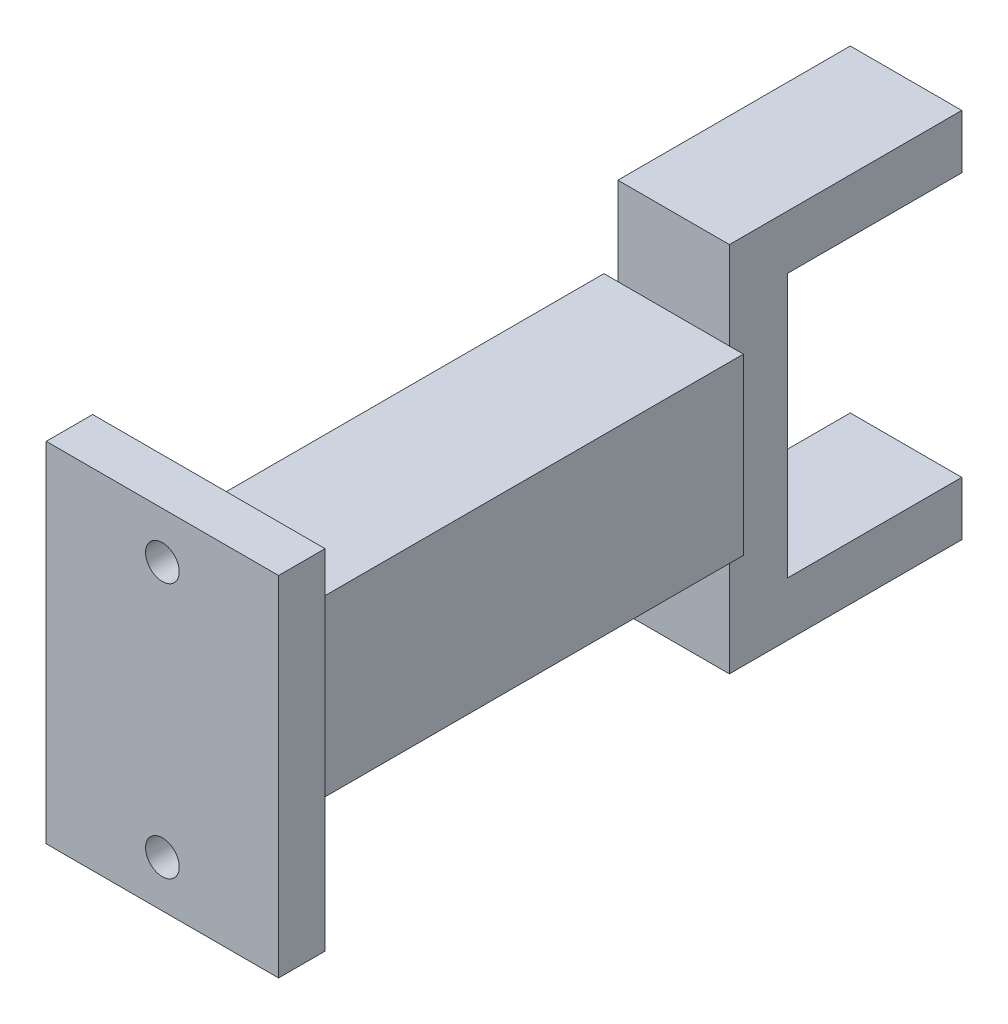
ISO-10303-21;
HEADER;
FILE_DESCRIPTION(('STEP AP214'),'2;1');
FILE_NAME('part.step','',(''),(''),'','','');
FILE_SCHEMA(('AUTOMOTIVE_DESIGN { 1 0 10303 214 1 1 1 1 }'));
ENDSEC;
DATA;
#1=APPLICATION_CONTEXT('core data for automotive mechanical design processes');
#2=APPLICATION_PROTOCOL_DEFINITION('international standard','automotive_design',2000,#1);
#3=PRODUCT_CONTEXT('',#1,'mechanical');
#4=PRODUCT('Part','Part','',(#3));
#5=PRODUCT_RELATED_PRODUCT_CATEGORY('part','',(#4));
#6=PRODUCT_DEFINITION_FORMATION('','',#4);
#7=PRODUCT_DEFINITION_CONTEXT('part definition',#1,'design');
#8=PRODUCT_DEFINITION('design','',#6,#7);
#9=PRODUCT_DEFINITION_SHAPE('','',#8);
#10=(LENGTH_UNIT() NAMED_UNIT(*) SI_UNIT(.MILLI.,.METRE.));
#11=(NAMED_UNIT(*) PLANE_ANGLE_UNIT() SI_UNIT($,.RADIAN.));
#12=(NAMED_UNIT(*) SI_UNIT($,.STERADIAN.) SOLID_ANGLE_UNIT());
#13=UNCERTAINTY_MEASURE_WITH_UNIT(LENGTH_MEASURE(1.E-05),#10,'distance_accuracy_value','');
#14=(GEOMETRIC_REPRESENTATION_CONTEXT(3) GLOBAL_UNCERTAINTY_ASSIGNED_CONTEXT((#13)) GLOBAL_UNIT_ASSIGNED_CONTEXT((#10,
#11,#12)) REPRESENTATION_CONTEXT('',''));
#15=CARTESIAN_POINT('',(0.,0.,0.));
#16=DIRECTION('',(0.,0.,1.));
#17=DIRECTION('',(1.,0.,0.));
#18=AXIS2_PLACEMENT_3D('',#15,#16,#17);
#19=CARTESIAN_POINT('',(0.,0.,-60.));
#20=DIRECTION('',(0.,0.,-1.));
#21=DIRECTION('',(-1.,0.,0.));
#22=AXIS2_PLACEMENT_3D('',#19,#20,#21);
#23=PLANE('',#22);
#24=DIRECTION('',(-1.,0.,0.));
#25=VECTOR('',#24,1.);
#26=CARTESIAN_POINT('',(2.99494584837546,-11.2924629697789,-60.));
#27=LINE('',#26,#25);
#28=CARTESIAN_POINT('',(2.99494584837546,-11.2924629697789,-60.));
#29=VERTEX_POINT('',#28);
#30=CARTESIAN_POINT('',(-6.60505415162454,-11.2924629697789,-60.));
#31=VERTEX_POINT('',#30);
#32=EDGE_CURVE('E185',#29,#31,#27,.T.);
#33=ORIENTED_EDGE('',*,*,#32,.F.);
#34=DIRECTION('',(0.,-1.,0.));
#35=VECTOR('',#34,1.);
#36=CARTESIAN_POINT('',(2.99494584837546,16.0575370302211,-60.));
#37=LINE('',#36,#35);
#38=CARTESIAN_POINT('',(2.99494584837546,-15.9424629697789,-60.));
#39=VERTEX_POINT('',#38);
#40=EDGE_CURVE('E207',#29,#39,#37,.T.);
#41=ORIENTED_EDGE('',*,*,#40,.T.);
#42=DIRECTION('',(-1.,0.,0.));
#43=VECTOR('',#42,1.);
#44=CARTESIAN_POINT('',(2.99494584837546,-15.9424629697789,-60.));
#45=LINE('',#44,#43);
#46=CARTESIAN_POINT('',(-6.60505415162454,-15.9424629697789,-60.));
#47=VERTEX_POINT('',#46);
#48=EDGE_CURVE('E212',#39,#47,#45,.T.);
#49=ORIENTED_EDGE('',*,*,#48,.T.);
#50=DIRECTION('',(0.,1.,0.));
#51=VECTOR('',#50,1.);
#52=CARTESIAN_POINT('',(-6.60505415162454,16.0575370302211,-60.));
#53=LINE('',#52,#51);
#54=EDGE_CURVE('E200',#47,#31,#53,.T.);
#55=ORIENTED_EDGE('',*,*,#54,.T.);
#56=EDGE_LOOP('',(#33,#41,#49,#55));
#57=FACE_BOUND('',#56,.T.);
#58=ADVANCED_FACE('F39',(#57),#23,.T.);
#59=CARTESIAN_POINT('',(0.,0.,-40.));
#60=DIRECTION('',(0.,0.,-1.));
#61=DIRECTION('',(-1.,0.,0.));
#62=AXIS2_PLACEMENT_3D('',#59,#60,#61);
#63=PLANE('',#62);
#64=DIRECTION('',(0.,1.,0.));
#65=VECTOR('',#64,1.);
#66=CARTESIAN_POINT('',(-6.60505415162454,16.0575370302211,-40.));
#67=LINE('',#66,#65);
#68=CARTESIAN_POINT('',(-6.60505415162454,-6.50722021660649,-40.));
#69=VERTEX_POINT('',#68);
#70=CARTESIAN_POINT('',(-6.60505415162454,8.49277978339351,-40.));
#71=VERTEX_POINT('',#70);
#72=EDGE_CURVE('E11',#69,#71,#67,.T.);
#73=ORIENTED_EDGE('',*,*,#72,.F.);
#74=DIRECTION('',(-1.,0.,0.));
#75=VECTOR('',#74,1.);
#76=CARTESIAN_POINT('',(4.19494584837546,-6.50722021660649,-40.));
#77=LINE('',#76,#75);
#78=CARTESIAN_POINT('',(-7.80505415162454,-6.50722021660649,-40.));
#79=VERTEX_POINT('',#78);
#80=EDGE_CURVE('E258',#69,#79,#77,.T.);
#81=ORIENTED_EDGE('',*,*,#80,.T.);
#82=DIRECTION('',(0.,1.,0.));
#83=VECTOR('',#82,1.);
#84=CARTESIAN_POINT('',(-7.80505415162454,8.49277978339351,-40.));
#85=LINE('',#84,#83);
#86=CARTESIAN_POINT('',(-7.80505415162454,8.49277978339351,-40.));
#87=VERTEX_POINT('',#86);
#88=EDGE_CURVE('E245',#79,#87,#85,.T.);
#89=ORIENTED_EDGE('',*,*,#88,.T.);
#90=DIRECTION('',(1.,0.,0.));
#91=VECTOR('',#90,1.);
#92=CARTESIAN_POINT('',(4.19494584837546,8.49277978339351,-40.));
#93=LINE('',#92,#91);
#94=EDGE_CURVE('E251',#87,#71,#93,.T.);
#95=ORIENTED_EDGE('',*,*,#94,.T.);
#96=EDGE_LOOP('',(#73,#81,#89,#95));
#97=FACE_BOUND('',#96,.T.);
#98=ADVANCED_FACE('F414',(#97),#63,.T.);
#99=CARTESIAN_POINT('',(0.,0.,0.));
#100=DIRECTION('',(0.,0.,1.));
#101=DIRECTION('',(1.,0.,0.));
#102=AXIS2_PLACEMENT_3D('',#99,#100,#101);
#103=PLANE('',#102);
#104=CARTESIAN_POINT('',(-1.80505415162455,-10.0072202166065,0.));
#105=DIRECTION('',(0.,0.,1.));
#106=DIRECTION('',(1.,0.,0.));
#107=AXIS2_PLACEMENT_3D('',#104,#105,#106);
#108=CIRCLE('',#107,1.45);
#109=CARTESIAN_POINT('',(-0.355054151624547,-10.0072202166065,0.));
#110=VERTEX_POINT('',#109);
#111=EDGE_CURVE('E293',#110,#110,#108,.T.);
#112=ORIENTED_EDGE('',*,*,#111,.T.);
#113=EDGE_LOOP('',(#112));
#114=FACE_BOUND('',#113,.T.);
#115=CARTESIAN_POINT('',(-1.80505415162455,11.9927797833935,0.));
#116=DIRECTION('',(0.,0.,1.));
#117=DIRECTION('',(1.,0.,0.));
#118=AXIS2_PLACEMENT_3D('',#115,#116,#117);
#119=CIRCLE('',#118,1.45);
#120=CARTESIAN_POINT('',(-0.355054151624547,11.9927797833935,0.));
#121=VERTEX_POINT('',#120);
#122=EDGE_CURVE('E298',#121,#121,#119,.T.);
#123=ORIENTED_EDGE('',*,*,#122,.T.);
#124=EDGE_LOOP('',(#123));
#125=FACE_BOUND('',#124,.T.);
#126=DIRECTION('',(0.,1.,0.));
#127=VECTOR('',#126,1.);
#128=CARTESIAN_POINT('',(8.19494584837545,15.9927797833935,0.));
#129=LINE('',#128,#127);
#130=CARTESIAN_POINT('',(8.19494584837546,-14.0072202166065,0.));
#131=VERTEX_POINT('',#130);
#132=CARTESIAN_POINT('',(8.19494584837545,15.9927797833935,0.));
#133=VERTEX_POINT('',#132);
#134=EDGE_CURVE('E306',#131,#133,#129,.T.);
#135=ORIENTED_EDGE('',*,*,#134,.F.);
#136=DIRECTION('',(1.,0.,0.));
#137=VECTOR('',#136,1.);
#138=CARTESIAN_POINT('',(-11.8050541516245,-14.0072202166065,0.));
#139=LINE('',#138,#137);
#140=CARTESIAN_POINT('',(-11.8050541516245,-14.0072202166065,0.));
#141=VERTEX_POINT('',#140);
#142=EDGE_CURVE('E315',#141,#131,#139,.T.);
#143=ORIENTED_EDGE('',*,*,#142,.F.);
#144=DIRECTION('',(0.,-1.,0.));
#145=VECTOR('',#144,1.);
#146=CARTESIAN_POINT('',(-11.8050541516245,15.9927797833935,0.));
#147=LINE('',#146,#145);
#148=CARTESIAN_POINT('',(-11.8050541516245,15.9927797833935,0.));
#149=VERTEX_POINT('',#148);
#150=EDGE_CURVE('E331',#149,#141,#147,.T.);
#151=ORIENTED_EDGE('',*,*,#150,.F.);
#152=DIRECTION('',(-1.,0.,0.));
#153=VECTOR('',#152,1.);
#154=CARTESIAN_POINT('',(-11.8050541516245,15.9927797833935,0.));
#155=LINE('',#154,#153);
#156=EDGE_CURVE('E328',#133,#149,#155,.T.);
#157=ORIENTED_EDGE('',*,*,#156,.F.);
#158=EDGE_LOOP('',(#135,#143,#151,#157));
#159=FACE_BOUND('',#158,.T.);
#160=DIRECTION('',(0.,1.,0.));
#161=VECTOR('',#160,1.);
#162=CARTESIAN_POINT('',(-7.80505415162454,8.49277978339351,0.));
#163=LINE('',#162,#161);
#164=CARTESIAN_POINT('',(-7.80505415162454,-6.50722021660649,0.));
#165=VERTEX_POINT('',#164);
#166=CARTESIAN_POINT('',(-7.80505415162454,8.49277978339351,0.));
#167=VERTEX_POINT('',#166);
#168=EDGE_CURVE('E244',#165,#167,#163,.T.);
#169=ORIENTED_EDGE('',*,*,#168,.F.);
#170=DIRECTION('',(-1.,0.,0.));
#171=VECTOR('',#170,1.);
#172=CARTESIAN_POINT('',(4.19494584837546,-6.50722021660649,0.));
#173=LINE('',#172,#171);
#174=CARTESIAN_POINT('',(4.19494584837546,-6.50722021660649,0.));
#175=VERTEX_POINT('',#174);
#176=EDGE_CURVE('E250',#175,#165,#173,.T.);
#177=ORIENTED_EDGE('',*,*,#176,.F.);
#178=DIRECTION('',(0.,-1.,0.));
#179=VECTOR('',#178,1.);
#180=CARTESIAN_POINT('',(4.19494584837546,8.49277978339351,0.));
#181=LINE('',#180,#179);
#182=CARTESIAN_POINT('',(4.19494584837546,8.49277978339351,0.));
#183=VERTEX_POINT('',#182);
#184=EDGE_CURVE('E271',#183,#175,#181,.T.);
#185=ORIENTED_EDGE('',*,*,#184,.F.);
#186=DIRECTION('',(1.,0.,0.));
#187=VECTOR('',#186,1.);
#188=CARTESIAN_POINT('',(4.19494584837546,8.49277978339351,0.));
#189=LINE('',#188,#187);
#190=EDGE_CURVE('E267',#167,#183,#189,.T.);
#191=ORIENTED_EDGE('',*,*,#190,.F.);
#192=EDGE_LOOP('',(#169,#177,#185,#191));
#193=FACE_BOUND('',#192,.T.);
#194=ADVANCED_FACE('F418',(#114,#125,#159,#193),#103,.F.);
#195=CARTESIAN_POINT('',(0.,0.,4.));
#196=DIRECTION('',(0.,0.,1.));
#197=DIRECTION('',(1.,0.,0.));
#198=AXIS2_PLACEMENT_3D('',#195,#196,#197);
#199=PLANE('',#198);
#200=CARTESIAN_POINT('',(-1.80505415162455,11.9927797833935,4.));
#201=DIRECTION('',(0.,0.,1.));
#202=DIRECTION('',(1.,0.,0.));
#203=AXIS2_PLACEMENT_3D('',#200,#201,#202);
#204=CIRCLE('',#203,1.45);
#205=CARTESIAN_POINT('',(-0.355054151624547,11.9927797833935,4.));
#206=VERTEX_POINT('',#205);
#207=EDGE_CURVE('E302',#206,#206,#204,.T.);
#208=ORIENTED_EDGE('',*,*,#207,.F.);
#209=EDGE_LOOP('',(#208));
#210=FACE_BOUND('',#209,.T.);
#211=DIRECTION('',(0.,1.,0.));
#212=VECTOR('',#211,1.);
#213=CARTESIAN_POINT('',(8.19494584837545,15.9927797833935,4.));
#214=LINE('',#213,#212);
#215=CARTESIAN_POINT('',(8.19494584837546,-14.0072202166065,4.));
#216=VERTEX_POINT('',#215);
#217=CARTESIAN_POINT('',(8.19494584837545,15.9927797833935,4.));
#218=VERTEX_POINT('',#217);
#219=EDGE_CURVE('E310',#216,#218,#214,.T.);
#220=ORIENTED_EDGE('',*,*,#219,.T.);
#221=DIRECTION('',(-1.,0.,0.));
#222=VECTOR('',#221,1.);
#223=CARTESIAN_POINT('',(-11.8050541516245,15.9927797833935,4.));
#224=LINE('',#223,#222);
#225=CARTESIAN_POINT('',(-11.8050541516245,15.9927797833935,4.));
#226=VERTEX_POINT('',#225);
#227=EDGE_CURVE('E314',#218,#226,#224,.T.);
#228=ORIENTED_EDGE('',*,*,#227,.T.);
#229=DIRECTION('',(0.,-1.,0.));
#230=VECTOR('',#229,1.);
#231=CARTESIAN_POINT('',(-11.8050541516245,15.9927797833935,4.));
#232=LINE('',#231,#230);
#233=CARTESIAN_POINT('',(-11.8050541516245,-14.0072202166065,4.));
#234=VERTEX_POINT('',#233);
#235=EDGE_CURVE('E318',#226,#234,#232,.T.);
#236=ORIENTED_EDGE('',*,*,#235,.T.);
#237=DIRECTION('',(1.,0.,0.));
#238=VECTOR('',#237,1.);
#239=CARTESIAN_POINT('',(-11.8050541516245,-14.0072202166065,4.));
#240=LINE('',#239,#238);
#241=EDGE_CURVE('E321',#234,#216,#240,.T.);
#242=ORIENTED_EDGE('',*,*,#241,.T.);
#243=EDGE_LOOP('',(#220,#228,#236,#242));
#244=FACE_BOUND('',#243,.T.);
#245=CARTESIAN_POINT('',(-1.80505415162455,-10.0072202166065,4.));
#246=DIRECTION('',(0.,0.,1.));
#247=DIRECTION('',(1.,0.,0.));
#248=AXIS2_PLACEMENT_3D('',#245,#246,#247);
#249=CIRCLE('',#248,1.45);
#250=CARTESIAN_POINT('',(-0.355054151624547,-10.0072202166065,4.));
#251=VERTEX_POINT('',#250);
#252=EDGE_CURVE('E294',#251,#251,#249,.T.);
#253=ORIENTED_EDGE('',*,*,#252,.F.);
#254=EDGE_LOOP('',(#253));
#255=FACE_BOUND('',#254,.T.);
#256=ADVANCED_FACE('F459',(#210,#244,#255),#199,.T.);
#257=CARTESIAN_POINT('',(8.19494584837545,15.9927797833935,4.));
#258=DIRECTION('',(-1.,0.,0.));
#259=DIRECTION('',(0.,-1.,0.));
#260=AXIS2_PLACEMENT_3D('',#257,#258,#259);
#261=PLANE('',#260);
#262=ORIENTED_EDGE('',*,*,#134,.T.);
#263=DIRECTION('',(0.,0.,-1.));
#264=VECTOR('',#263,1.);
#265=CARTESIAN_POINT('',(8.19494584837545,15.9927797833935,4.));
#266=LINE('',#265,#264);
#267=EDGE_CURVE('E43',#218,#133,#266,.T.);
#268=ORIENTED_EDGE('',*,*,#267,.F.);
#269=ORIENTED_EDGE('',*,*,#219,.F.);
#270=DIRECTION('',(0.,0.,-1.));
#271=VECTOR('',#270,1.);
#272=CARTESIAN_POINT('',(8.19494584837546,-14.0072202166065,4.));
#273=LINE('',#272,#271);
#274=EDGE_CURVE('E324',#216,#131,#273,.T.);
#275=ORIENTED_EDGE('',*,*,#274,.T.);
#276=EDGE_LOOP('',(#262,#268,#269,#275));
#277=FACE_BOUND('',#276,.T.);
#278=ADVANCED_FACE('F41',(#277),#261,.F.);
#279=CARTESIAN_POINT('',(-11.8050541516245,15.9927797833935,4.));
#280=DIRECTION('',(0.,-1.,0.));
#281=DIRECTION('',(0.,0.,-1.));
#282=AXIS2_PLACEMENT_3D('',#279,#280,#281);
#283=PLANE('',#282);
#284=ORIENTED_EDGE('',*,*,#156,.T.);
#285=DIRECTION('',(0.,0.,-1.));
#286=VECTOR('',#285,1.);
#287=CARTESIAN_POINT('',(-11.8050541516245,15.9927797833935,4.));
#288=LINE('',#287,#286);
#289=EDGE_CURVE('E342',#226,#149,#288,.T.);
#290=ORIENTED_EDGE('',*,*,#289,.F.);
#291=ORIENTED_EDGE('',*,*,#227,.F.);
#292=ORIENTED_EDGE('',*,*,#267,.T.);
#293=EDGE_LOOP('',(#284,#290,#291,#292));
#294=FACE_BOUND('',#293,.T.);
#295=ADVANCED_FACE('F471',(#294),#283,.F.);
#296=CARTESIAN_POINT('',(-11.8050541516245,15.9927797833935,4.));
#297=DIRECTION('',(1.,0.,0.));
#298=DIRECTION('',(0.,1.,0.));
#299=AXIS2_PLACEMENT_3D('',#296,#297,#298);
#300=PLANE('',#299);
#301=ORIENTED_EDGE('',*,*,#150,.T.);
#302=DIRECTION('',(0.,0.,-1.));
#303=VECTOR('',#302,1.);
#304=CARTESIAN_POINT('',(-11.8050541516245,-14.0072202166065,4.));
#305=LINE('',#304,#303);
#306=EDGE_CURVE('E339',#234,#141,#305,.T.);
#307=ORIENTED_EDGE('',*,*,#306,.F.);
#308=ORIENTED_EDGE('',*,*,#235,.F.);
#309=ORIENTED_EDGE('',*,*,#289,.T.);
#310=EDGE_LOOP('',(#301,#307,#308,#309));
#311=FACE_BOUND('',#310,.T.);
#312=ADVANCED_FACE('F468',(#311),#300,.F.);
#313=CARTESIAN_POINT('',(-11.8050541516245,-14.0072202166065,4.));
#314=DIRECTION('',(0.,1.,0.));
#315=DIRECTION('',(0.,0.,1.));
#316=AXIS2_PLACEMENT_3D('',#313,#314,#315);
#317=PLANE('',#316);
#318=ORIENTED_EDGE('',*,*,#142,.T.);
#319=ORIENTED_EDGE('',*,*,#274,.F.);
#320=ORIENTED_EDGE('',*,*,#241,.F.);
#321=ORIENTED_EDGE('',*,*,#306,.T.);
#322=EDGE_LOOP('',(#318,#319,#320,#321));
#323=FACE_BOUND('',#322,.T.);
#324=ADVANCED_FACE('F457',(#323),#317,.F.);
#325=CARTESIAN_POINT('',(-1.80505415162455,11.9927797833935,4.));
#326=DIRECTION('',(0.,0.,-1.));
#327=DIRECTION('',(-1.,0.,0.));
#328=AXIS2_PLACEMENT_3D('',#325,#326,#327);
#329=CYLINDRICAL_SURFACE('',#328,1.45);
#330=ORIENTED_EDGE('',*,*,#207,.T.);
#331=EDGE_LOOP('',(#330));
#332=FACE_BOUND('',#331,.T.);
#333=ORIENTED_EDGE('',*,*,#122,.F.);
#334=EDGE_LOOP('',(#333));
#335=FACE_BOUND('',#334,.T.);
#336=ADVANCED_FACE('F453',(#332,#335),#329,.F.);
#337=CARTESIAN_POINT('',(-1.80505415162455,-10.0072202166065,4.));
#338=DIRECTION('',(0.,0.,-1.));
#339=DIRECTION('',(-1.,0.,0.));
#340=AXIS2_PLACEMENT_3D('',#337,#338,#339);
#341=CYLINDRICAL_SURFACE('',#340,1.45);
#342=ORIENTED_EDGE('',*,*,#252,.T.);
#343=EDGE_LOOP('',(#342));
#344=FACE_BOUND('',#343,.T.);
#345=ORIENTED_EDGE('',*,*,#111,.F.);
#346=EDGE_LOOP('',(#345));
#347=FACE_BOUND('',#346,.T.);
#348=ADVANCED_FACE('F449',(#344,#347),#341,.F.);
#349=CARTESIAN_POINT('',(-7.80505415162454,8.49277978339351,-40.));
#350=DIRECTION('',(1.,0.,0.));
#351=DIRECTION('',(0.,0.,-1.));
#352=AXIS2_PLACEMENT_3D('',#349,#350,#351);
#353=PLANE('',#352);
#354=ORIENTED_EDGE('',*,*,#168,.T.);
#355=DIRECTION('',(0.,0.,1.));
#356=VECTOR('',#355,1.);
#357=CARTESIAN_POINT('',(-7.80505415162454,8.49277978339351,-40.));
#358=LINE('',#357,#356);
#359=EDGE_CURVE('E289',#87,#167,#358,.T.);
#360=ORIENTED_EDGE('',*,*,#359,.F.);
#361=ORIENTED_EDGE('',*,*,#88,.F.);
#362=DIRECTION('',(0.,0.,1.));
#363=VECTOR('',#362,1.);
#364=CARTESIAN_POINT('',(-7.80505415162454,-6.50722021660649,-40.));
#365=LINE('',#364,#363);
#366=EDGE_CURVE('E262',#79,#165,#365,.T.);
#367=ORIENTED_EDGE('',*,*,#366,.T.);
#368=EDGE_LOOP('',(#354,#360,#361,#367));
#369=FACE_BOUND('',#368,.T.);
#370=ADVANCED_FACE('F445',(#369),#353,.F.);
#371=CARTESIAN_POINT('',(4.19494584837546,8.49277978339351,-40.));
#372=DIRECTION('',(0.,-1.,0.));
#373=DIRECTION('',(0.,0.,-1.));
#374=AXIS2_PLACEMENT_3D('',#371,#372,#373);
#375=PLANE('',#374);
#376=ORIENTED_EDGE('',*,*,#190,.T.);
#377=DIRECTION('',(0.,0.,1.));
#378=VECTOR('',#377,1.);
#379=CARTESIAN_POINT('',(4.19494584837546,8.49277978339351,-40.));
#380=LINE('',#379,#378);
#381=CARTESIAN_POINT('',(4.19494584837546,8.49277978339351,-40.));
#382=VERTEX_POINT('',#381);
#383=EDGE_CURVE('E285',#382,#183,#380,.T.);
#384=ORIENTED_EDGE('',*,*,#383,.F.);
#385=CARTESIAN_POINT('',(2.99494584837546,8.49277978339351,-40.));
#386=VERTEX_POINT('',#385);
#387=EDGE_CURVE('E249',#386,#382,#93,.T.);
#388=ORIENTED_EDGE('',*,*,#387,.F.);
#389=EDGE_CURVE('E255',#71,#386,#93,.T.);
#390=ORIENTED_EDGE('',*,*,#389,.F.);
#391=ORIENTED_EDGE('',*,*,#94,.F.);
#392=ORIENTED_EDGE('',*,*,#359,.T.);
#393=EDGE_LOOP('',(#376,#384,#388,#390,#391,#392));
#394=FACE_BOUND('',#393,.T.);
#395=ADVANCED_FACE('F441',(#394),#375,.F.);
#396=CARTESIAN_POINT('',(4.19494584837546,8.49277978339351,-40.));
#397=DIRECTION('',(-1.,0.,0.));
#398=DIRECTION('',(0.,-1.,0.));
#399=AXIS2_PLACEMENT_3D('',#396,#397,#398);
#400=PLANE('',#399);
#401=ORIENTED_EDGE('',*,*,#184,.T.);
#402=DIRECTION('',(0.,0.,1.));
#403=VECTOR('',#402,1.);
#404=CARTESIAN_POINT('',(4.19494584837546,-6.50722021660649,-40.));
#405=LINE('',#404,#403);
#406=CARTESIAN_POINT('',(4.19494584837546,-6.50722021660649,-40.));
#407=VERTEX_POINT('',#406);
#408=EDGE_CURVE('E281',#407,#175,#405,.T.);
#409=ORIENTED_EDGE('',*,*,#408,.F.);
#410=DIRECTION('',(0.,-1.,0.));
#411=VECTOR('',#410,1.);
#412=CARTESIAN_POINT('',(4.19494584837546,8.49277978339351,-40.));
#413=LINE('',#412,#411);
#414=EDGE_CURVE('E254',#382,#407,#413,.T.);
#415=ORIENTED_EDGE('',*,*,#414,.F.);
#416=ORIENTED_EDGE('',*,*,#383,.T.);
#417=EDGE_LOOP('',(#401,#409,#415,#416));
#418=FACE_BOUND('',#417,.T.);
#419=ADVANCED_FACE('F437',(#418),#400,.F.);
#420=CARTESIAN_POINT('',(4.19494584837546,-6.50722021660649,-40.));
#421=DIRECTION('',(0.,1.,0.));
#422=DIRECTION('',(0.,0.,1.));
#423=AXIS2_PLACEMENT_3D('',#420,#421,#422);
#424=PLANE('',#423);
#425=ORIENTED_EDGE('',*,*,#176,.T.);
#426=ORIENTED_EDGE('',*,*,#366,.F.);
#427=ORIENTED_EDGE('',*,*,#80,.F.);
#428=CARTESIAN_POINT('',(2.99494584837546,-6.50722021660649,-40.));
#429=VERTEX_POINT('',#428);
#430=EDGE_CURVE('E263',#429,#69,#77,.T.);
#431=ORIENTED_EDGE('',*,*,#430,.F.);
#432=EDGE_CURVE('E259',#407,#429,#77,.T.);
#433=ORIENTED_EDGE('',*,*,#432,.F.);
#434=ORIENTED_EDGE('',*,*,#408,.T.);
#435=EDGE_LOOP('',(#425,#426,#427,#431,#433,#434));
#436=FACE_BOUND('',#435,.T.);
#437=ADVANCED_FACE('F433',(#436),#424,.F.);
#438=DIRECTION('',(0.,-1.,0.));
#439=VECTOR('',#438,1.);
#440=CARTESIAN_POINT('',(2.99494584837546,16.0575370302211,-40.));
#441=LINE('',#440,#439);
#442=EDGE_CURVE('E49',#386,#429,#441,.T.);
#443=ORIENTED_EDGE('',*,*,#442,.F.);
#444=ORIENTED_EDGE('',*,*,#387,.T.);
#445=ORIENTED_EDGE('',*,*,#414,.T.);
#446=ORIENTED_EDGE('',*,*,#432,.T.);
#447=EDGE_LOOP('',(#443,#444,#445,#446));
#448=FACE_BOUND('',#447,.T.);
#449=ADVANCED_FACE('F420',(#448),#63,.T.);
#450=CARTESIAN_POINT('',(0.,0.,-40.));
#451=DIRECTION('',(0.,0.,-1.));
#452=DIRECTION('',(-1.,0.,0.));
#453=AXIS2_PLACEMENT_3D('',#450,#451,#452);
#454=PLANE('',#453);
#455=CARTESIAN_POINT('',(-6.60505415162454,16.0575370302211,-40.));
#456=VERTEX_POINT('',#455);
#457=EDGE_CURVE('E52',#71,#456,#67,.T.);
#458=ORIENTED_EDGE('',*,*,#457,.F.);
#459=ORIENTED_EDGE('',*,*,#389,.T.);
#460=CARTESIAN_POINT('',(2.99494584837546,16.0575370302211,-40.));
#461=VERTEX_POINT('',#460);
#462=EDGE_CURVE('E222',#461,#386,#441,.T.);
#463=ORIENTED_EDGE('',*,*,#462,.F.);
#464=DIRECTION('',(1.,0.,0.));
#465=VECTOR('',#464,1.);
#466=CARTESIAN_POINT('',(2.99494584837546,16.0575370302211,-40.));
#467=LINE('',#466,#465);
#468=EDGE_CURVE('E218',#456,#461,#467,.T.);
#469=ORIENTED_EDGE('',*,*,#468,.F.);
#470=EDGE_LOOP('',(#458,#459,#463,#469));
#471=FACE_BOUND('',#470,.T.);
#472=ADVANCED_FACE('F392',(#471),#454,.F.);
#473=CARTESIAN_POINT('',(2.99494584837546,-15.9424629697789,-40.));
#474=VERTEX_POINT('',#473);
#475=EDGE_CURVE('E221',#429,#474,#441,.T.);
#476=ORIENTED_EDGE('',*,*,#475,.F.);
#477=ORIENTED_EDGE('',*,*,#430,.T.);
#478=CARTESIAN_POINT('',(-6.60505415162454,-15.9424629697789,-40.));
#479=VERTEX_POINT('',#478);
#480=EDGE_CURVE('E51',#479,#69,#67,.T.);
#481=ORIENTED_EDGE('',*,*,#480,.F.);
#482=DIRECTION('',(-1.,0.,0.));
#483=VECTOR('',#482,1.);
#484=CARTESIAN_POINT('',(2.99494584837546,-15.9424629697789,-40.));
#485=LINE('',#484,#483);
#486=EDGE_CURVE('E226',#474,#479,#485,.T.);
#487=ORIENTED_EDGE('',*,*,#486,.F.);
#488=EDGE_LOOP('',(#476,#477,#481,#487));
#489=FACE_BOUND('',#488,.T.);
#490=ADVANCED_FACE('F369',(#489),#454,.F.);
#491=CARTESIAN_POINT('',(-6.60505415162454,16.0575370302211,-60.));
#492=DIRECTION('',(1.,0.,0.));
#493=DIRECTION('',(0.,1.,0.));
#494=AXIS2_PLACEMENT_3D('',#491,#492,#493);
#495=PLANE('',#494);
#496=DIRECTION('',(0.,1.,0.));
#497=VECTOR('',#496,1.);
#498=CARTESIAN_POINT('',(-6.60505415162454,11.4075370302211,-45.));
#499=LINE('',#498,#497);
#500=CARTESIAN_POINT('',(-6.60505415162454,-11.2924629697789,-45.));
#501=VERTEX_POINT('',#500);
#502=CARTESIAN_POINT('',(-6.60505415162454,11.4075370302211,-45.));
#503=VERTEX_POINT('',#502);
#504=EDGE_CURVE('E175',#501,#503,#499,.T.);
#505=ORIENTED_EDGE('',*,*,#504,.F.);
#506=DIRECTION('',(0.,0.,-1.));
#507=VECTOR('',#506,1.);
#508=CARTESIAN_POINT('',(-6.60505415162454,-11.2924629697789,-45.));
#509=LINE('',#508,#507);
#510=EDGE_CURVE('E372',#501,#31,#509,.T.);
#511=ORIENTED_EDGE('',*,*,#510,.T.);
#512=ORIENTED_EDGE('',*,*,#54,.F.);
#513=DIRECTION('',(0.,0.,1.));
#514=VECTOR('',#513,1.);
#515=CARTESIAN_POINT('',(-6.60505415162454,-15.9424629697789,-60.));
#516=LINE('',#515,#514);
#517=EDGE_CURVE('E214',#47,#479,#516,.T.);
#518=ORIENTED_EDGE('',*,*,#517,.T.);
#519=ORIENTED_EDGE('',*,*,#480,.T.);
#520=ORIENTED_EDGE('',*,*,#72,.T.);
#521=ORIENTED_EDGE('',*,*,#457,.T.);
#522=DIRECTION('',(0.,0.,1.));
#523=VECTOR('',#522,1.);
#524=CARTESIAN_POINT('',(-6.60505415162454,16.0575370302211,-60.));
#525=LINE('',#524,#523);
#526=CARTESIAN_POINT('',(-6.60505415162454,16.0575370302211,-60.));
#527=VERTEX_POINT('',#526);
#528=EDGE_CURVE('E240',#527,#456,#525,.T.);
#529=ORIENTED_EDGE('',*,*,#528,.F.);
#530=CARTESIAN_POINT('',(-6.60505415162454,11.4075370302211,-60.));
#531=VERTEX_POINT('',#530);
#532=EDGE_CURVE('E190',#531,#527,#53,.T.);
#533=ORIENTED_EDGE('',*,*,#532,.F.);
#534=DIRECTION('',(0.,0.,-1.));
#535=VECTOR('',#534,1.);
#536=CARTESIAN_POINT('',(-6.60505415162454,11.4075370302211,-45.));
#537=LINE('',#536,#535);
#538=EDGE_CURVE('E59',#503,#531,#537,.T.);
#539=ORIENTED_EDGE('',*,*,#538,.F.);
#540=EDGE_LOOP('',(#505,#511,#512,#518,#519,#520,#521,#529,#533,#539));
#541=FACE_BOUND('',#540,.T.);
#542=ADVANCED_FACE('F188',(#541),#495,.F.);
#543=CARTESIAN_POINT('',(2.99494584837546,16.0575370302211,-60.));
#544=DIRECTION('',(0.,-1.,0.));
#545=DIRECTION('',(0.,0.,-1.));
#546=AXIS2_PLACEMENT_3D('',#543,#544,#545);
#547=PLANE('',#546);
#548=ORIENTED_EDGE('',*,*,#468,.T.);
#549=DIRECTION('',(0.,0.,1.));
#550=VECTOR('',#549,1.);
#551=CARTESIAN_POINT('',(2.99494584837546,16.0575370302211,-60.));
#552=LINE('',#551,#550);
#553=CARTESIAN_POINT('',(2.99494584837546,16.0575370302211,-60.));
#554=VERTEX_POINT('',#553);
#555=EDGE_CURVE('E236',#554,#461,#552,.T.);
#556=ORIENTED_EDGE('',*,*,#555,.F.);
#557=DIRECTION('',(1.,0.,0.));
#558=VECTOR('',#557,1.);
#559=CARTESIAN_POINT('',(2.99494584837546,16.0575370302211,-60.));
#560=LINE('',#559,#558);
#561=EDGE_CURVE('E204',#527,#554,#560,.T.);
#562=ORIENTED_EDGE('',*,*,#561,.F.);
#563=ORIENTED_EDGE('',*,*,#528,.T.);
#564=EDGE_LOOP('',(#548,#556,#562,#563));
#565=FACE_BOUND('',#564,.T.);
#566=ADVANCED_FACE('F384',(#565),#547,.F.);
#567=CARTESIAN_POINT('',(2.99494584837546,16.0575370302211,-60.));
#568=DIRECTION('',(-1.,0.,0.));
#569=DIRECTION('',(0.,-1.,0.));
#570=AXIS2_PLACEMENT_3D('',#567,#568,#569);
#571=PLANE('',#570);
#572=ORIENTED_EDGE('',*,*,#40,.F.);
#573=DIRECTION('',(0.,0.,-1.));
#574=VECTOR('',#573,1.);
#575=CARTESIAN_POINT('',(2.99494584837546,-11.2924629697789,-45.));
#576=LINE('',#575,#574);
#577=CARTESIAN_POINT('',(2.99494584837546,-11.2924629697789,-45.));
#578=VERTEX_POINT('',#577);
#579=EDGE_CURVE('E195',#578,#29,#576,.T.);
#580=ORIENTED_EDGE('',*,*,#579,.F.);
#581=DIRECTION('',(0.,-1.,0.));
#582=VECTOR('',#581,1.);
#583=CARTESIAN_POINT('',(2.99494584837546,11.4075370302211,-45.));
#584=LINE('',#583,#582);
#585=CARTESIAN_POINT('',(2.99494584837546,11.4075370302211,-45.));
#586=VERTEX_POINT('',#585);
#587=EDGE_CURVE('E174',#586,#578,#584,.T.);
#588=ORIENTED_EDGE('',*,*,#587,.F.);
#589=DIRECTION('',(0.,0.,-1.));
#590=VECTOR('',#589,1.);
#591=CARTESIAN_POINT('',(2.99494584837546,11.4075370302211,-45.));
#592=LINE('',#591,#590);
#593=CARTESIAN_POINT('',(2.99494584837546,11.4075370302211,-60.));
#594=VERTEX_POINT('',#593);
#595=EDGE_CURVE('E170',#586,#594,#592,.T.);
#596=ORIENTED_EDGE('',*,*,#595,.T.);
#597=EDGE_CURVE('E208',#554,#594,#37,.T.);
#598=ORIENTED_EDGE('',*,*,#597,.F.);
#599=ORIENTED_EDGE('',*,*,#555,.T.);
#600=ORIENTED_EDGE('',*,*,#462,.T.);
#601=ORIENTED_EDGE('',*,*,#442,.T.);
#602=ORIENTED_EDGE('',*,*,#475,.T.);
#603=DIRECTION('',(0.,0.,1.));
#604=VECTOR('',#603,1.);
#605=CARTESIAN_POINT('',(2.99494584837546,-15.9424629697789,-60.));
#606=LINE('',#605,#604);
#607=EDGE_CURVE('E232',#39,#474,#606,.T.);
#608=ORIENTED_EDGE('',*,*,#607,.F.);
#609=EDGE_LOOP('',(#572,#580,#588,#596,#598,#599,#600,#601,#602,#608));
#610=FACE_BOUND('',#609,.T.);
#611=ADVANCED_FACE('F360',(#610),#571,.F.);
#612=CARTESIAN_POINT('',(2.99494584837546,-15.9424629697789,-60.));
#613=DIRECTION('',(0.,1.,0.));
#614=DIRECTION('',(0.,0.,1.));
#615=AXIS2_PLACEMENT_3D('',#612,#613,#614);
#616=PLANE('',#615);
#617=ORIENTED_EDGE('',*,*,#486,.T.);
#618=ORIENTED_EDGE('',*,*,#517,.F.);
#619=ORIENTED_EDGE('',*,*,#48,.F.);
#620=ORIENTED_EDGE('',*,*,#607,.T.);
#621=EDGE_LOOP('',(#617,#618,#619,#620));
#622=FACE_BOUND('',#621,.T.);
#623=ADVANCED_FACE('F366',(#622),#616,.F.);
#624=DIRECTION('',(1.,0.,0.));
#625=VECTOR('',#624,1.);
#626=CARTESIAN_POINT('',(2.99494584837546,11.4075370302211,-60.));
#627=LINE('',#626,#625);
#628=EDGE_CURVE('E382',#531,#594,#627,.T.);
#629=ORIENTED_EDGE('',*,*,#628,.F.);
#630=ORIENTED_EDGE('',*,*,#532,.T.);
#631=ORIENTED_EDGE('',*,*,#561,.T.);
#632=ORIENTED_EDGE('',*,*,#597,.T.);
#633=EDGE_LOOP('',(#629,#630,#631,#632));
#634=FACE_BOUND('',#633,.T.);
#635=ADVANCED_FACE('F380',(#634),#23,.T.);
#636=CARTESIAN_POINT('',(2.99494584837546,-11.2924629697789,-45.));
#637=DIRECTION('',(0.,-1.,0.));
#638=DIRECTION('',(0.,0.,-1.));
#639=AXIS2_PLACEMENT_3D('',#636,#637,#638);
#640=PLANE('',#639);
#641=ORIENTED_EDGE('',*,*,#32,.T.);
#642=ORIENTED_EDGE('',*,*,#510,.F.);
#643=DIRECTION('',(-1.,0.,0.));
#644=VECTOR('',#643,1.);
#645=CARTESIAN_POINT('',(2.99494584837546,-11.2924629697789,-45.));
#646=LINE('',#645,#644);
#647=EDGE_CURVE('E181',#578,#501,#646,.T.);
#648=ORIENTED_EDGE('',*,*,#647,.F.);
#649=ORIENTED_EDGE('',*,*,#579,.T.);
#650=EDGE_LOOP('',(#641,#642,#648,#649));
#651=FACE_BOUND('',#650,.T.);
#652=ADVANCED_FACE('F403',(#651),#640,.F.);
#653=CARTESIAN_POINT('',(2.99494584837546,11.4075370302211,-45.));
#654=DIRECTION('',(0.,1.,0.));
#655=DIRECTION('',(0.,0.,1.));
#656=AXIS2_PLACEMENT_3D('',#653,#654,#655);
#657=PLANE('',#656);
#658=ORIENTED_EDGE('',*,*,#628,.T.);
#659=ORIENTED_EDGE('',*,*,#595,.F.);
#660=DIRECTION('',(1.,0.,0.));
#661=VECTOR('',#660,1.);
#662=CARTESIAN_POINT('',(2.99494584837546,11.4075370302211,-45.));
#663=LINE('',#662,#661);
#664=EDGE_CURVE('E166',#503,#586,#663,.T.);
#665=ORIENTED_EDGE('',*,*,#664,.F.);
#666=ORIENTED_EDGE('',*,*,#538,.T.);
#667=EDGE_LOOP('',(#658,#659,#665,#666));
#668=FACE_BOUND('',#667,.T.);
#669=ADVANCED_FACE('F168',(#668),#657,.F.);
#670=CARTESIAN_POINT('',(0.,0.,-45.));
#671=DIRECTION('',(0.,0.,-1.));
#672=DIRECTION('',(-1.,0.,0.));
#673=AXIS2_PLACEMENT_3D('',#670,#671,#672);
#674=PLANE('',#673);
#675=ORIENTED_EDGE('',*,*,#504,.T.);
#676=ORIENTED_EDGE('',*,*,#664,.T.);
#677=ORIENTED_EDGE('',*,*,#587,.T.);
#678=ORIENTED_EDGE('',*,*,#647,.T.);
#679=EDGE_LOOP('',(#675,#676,#677,#678));
#680=FACE_BOUND('',#679,.T.);
#681=ADVANCED_FACE('F179',(#680),#674,.T.);
#682=CLOSED_SHELL('',(#58,#98,#194,#256,#278,#295,#312,#324,#336,#348,#370,#395,#419,#437,#449,
#472,#490,#542,#566,#611,#623,#635,#652,#669,#681));
#683=MANIFOLD_SOLID_BREP('B2',#682);
#684=ADVANCED_BREP_SHAPE_REPRESENTATION('',(#18,#683),#14);
#685=SHAPE_DEFINITION_REPRESENTATION(#9,#684);
ENDSEC;
END-ISO-10303-21;
